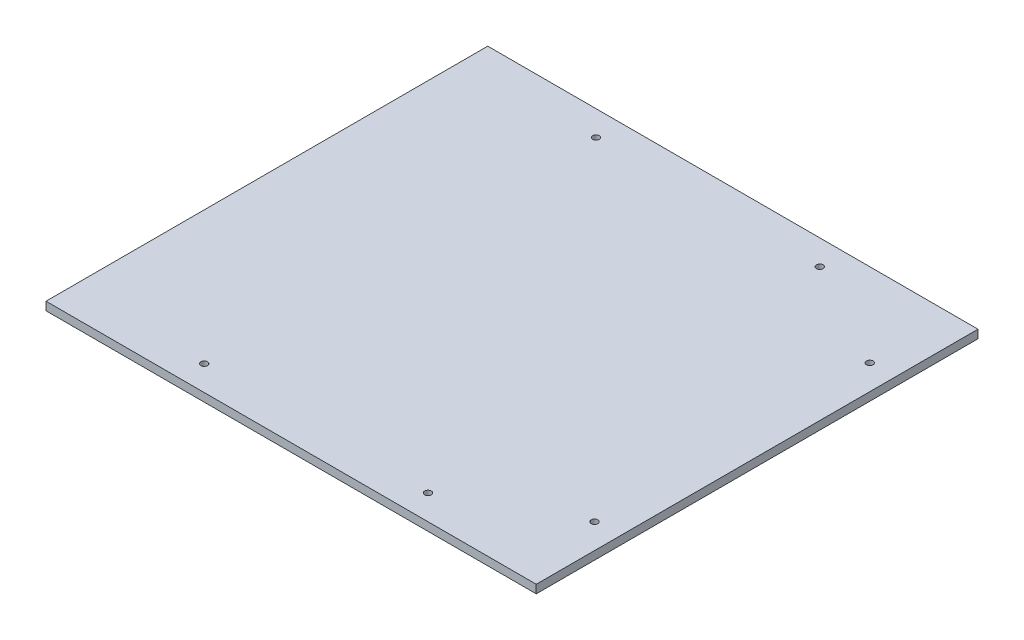
ISO-10303-21;
HEADER;
FILE_DESCRIPTION(('STEP AP214'),'2;1');
FILE_NAME('part.step','',(''),(''),'','','');
FILE_SCHEMA(('AUTOMOTIVE_DESIGN { 1 0 10303 214 1 1 1 1 }'));
ENDSEC;
DATA;
#1=APPLICATION_CONTEXT('core data for automotive mechanical design processes');
#2=APPLICATION_PROTOCOL_DEFINITION('international standard','automotive_design',2000,#1);
#3=PRODUCT_CONTEXT('',#1,'mechanical');
#4=PRODUCT('Part','Part','',(#3));
#5=PRODUCT_RELATED_PRODUCT_CATEGORY('part','',(#4));
#6=PRODUCT_DEFINITION_FORMATION('','',#4);
#7=PRODUCT_DEFINITION_CONTEXT('part definition',#1,'design');
#8=PRODUCT_DEFINITION('design','',#6,#7);
#9=PRODUCT_DEFINITION_SHAPE('','',#8);
#10=(LENGTH_UNIT() NAMED_UNIT(*) SI_UNIT(.MILLI.,.METRE.));
#11=(NAMED_UNIT(*) PLANE_ANGLE_UNIT() SI_UNIT($,.RADIAN.));
#12=(NAMED_UNIT(*) SI_UNIT($,.STERADIAN.) SOLID_ANGLE_UNIT());
#13=UNCERTAINTY_MEASURE_WITH_UNIT(LENGTH_MEASURE(1.E-05),#10,'distance_accuracy_value','');
#14=(GEOMETRIC_REPRESENTATION_CONTEXT(3) GLOBAL_UNCERTAINTY_ASSIGNED_CONTEXT((#13)) GLOBAL_UNIT_ASSIGNED_CONTEXT((#10,
#11,#12)) REPRESENTATION_CONTEXT('',''));
#15=CARTESIAN_POINT('',(0.,0.,0.));
#16=DIRECTION('',(0.,0.,1.));
#17=DIRECTION('',(1.,0.,0.));
#18=AXIS2_PLACEMENT_3D('',#15,#16,#17);
#19=CARTESIAN_POINT('',(-147.2,5.,-132.64));
#20=DIRECTION('',(1.,0.,0.));
#21=DIRECTION('',(0.,0.,-1.));
#22=AXIS2_PLACEMENT_3D('',#19,#20,#21);
#23=PLANE('',#22);
#24=DIRECTION('',(0.,0.,1.));
#25=VECTOR('',#24,1.);
#26=CARTESIAN_POINT('',(-147.2,0.,-132.64));
#27=LINE('',#26,#25);
#28=CARTESIAN_POINT('',(-147.2,0.,-132.64));
#29=VERTEX_POINT('',#28);
#30=CARTESIAN_POINT('',(-147.2,0.,132.64));
#31=VERTEX_POINT('',#30);
#32=EDGE_CURVE('E112',#29,#31,#27,.T.);
#33=ORIENTED_EDGE('',*,*,#32,.T.);
#34=DIRECTION('',(0.,-1.,0.));
#35=VECTOR('',#34,1.);
#36=CARTESIAN_POINT('',(-147.2,5.,132.64));
#37=LINE('',#36,#35);
#38=CARTESIAN_POINT('',(-147.2,5.,132.64));
#39=VERTEX_POINT('',#38);
#40=EDGE_CURVE('E11',#39,#31,#37,.T.);
#41=ORIENTED_EDGE('',*,*,#40,.F.);
#42=DIRECTION('',(0.,0.,1.));
#43=VECTOR('',#42,1.);
#44=CARTESIAN_POINT('',(-147.2,5.,-132.64));
#45=LINE('',#44,#43);
#46=CARTESIAN_POINT('',(-147.2,5.,-132.64));
#47=VERTEX_POINT('',#46);
#48=EDGE_CURVE('E96',#47,#39,#45,.T.);
#49=ORIENTED_EDGE('',*,*,#48,.F.);
#50=DIRECTION('',(0.,-1.,0.));
#51=VECTOR('',#50,1.);
#52=CARTESIAN_POINT('',(-147.2,5.,-132.64));
#53=LINE('',#52,#51);
#54=EDGE_CURVE('E108',#47,#29,#53,.T.);
#55=ORIENTED_EDGE('',*,*,#54,.T.);
#56=EDGE_LOOP('',(#33,#41,#49,#55));
#57=FACE_BOUND('',#56,.T.);
#58=ADVANCED_FACE('F44',(#57),#23,.F.);
#59=CARTESIAN_POINT('',(-147.2,5.,132.64));
#60=DIRECTION('',(0.,0.,-1.));
#61=DIRECTION('',(-1.,0.,0.));
#62=AXIS2_PLACEMENT_3D('',#59,#60,#61);
#63=PLANE('',#62);
#64=DIRECTION('',(1.,0.,0.));
#65=VECTOR('',#64,1.);
#66=CARTESIAN_POINT('',(-147.2,0.,132.64));
#67=LINE('',#66,#65);
#68=CARTESIAN_POINT('',(147.2,0.,132.64));
#69=VERTEX_POINT('',#68);
#70=EDGE_CURVE('E101',#31,#69,#67,.T.);
#71=ORIENTED_EDGE('',*,*,#70,.T.);
#72=DIRECTION('',(0.,-1.,0.));
#73=VECTOR('',#72,1.);
#74=CARTESIAN_POINT('',(147.2,5.,132.64));
#75=LINE('',#74,#73);
#76=CARTESIAN_POINT('',(147.2,5.,132.64));
#77=VERTEX_POINT('',#76);
#78=EDGE_CURVE('E53',#77,#69,#75,.T.);
#79=ORIENTED_EDGE('',*,*,#78,.F.);
#80=DIRECTION('',(1.,0.,0.));
#81=VECTOR('',#80,1.);
#82=CARTESIAN_POINT('',(-147.2,5.,132.64));
#83=LINE('',#82,#81);
#84=EDGE_CURVE('E91',#39,#77,#83,.T.);
#85=ORIENTED_EDGE('',*,*,#84,.F.);
#86=ORIENTED_EDGE('',*,*,#40,.T.);
#87=EDGE_LOOP('',(#71,#79,#85,#86));
#88=FACE_BOUND('',#87,.T.);
#89=ADVANCED_FACE('F100',(#88),#63,.F.);
#90=CARTESIAN_POINT('',(147.2,5.,-132.64));
#91=DIRECTION('',(-1.,0.,0.));
#92=DIRECTION('',(0.,0.,1.));
#93=AXIS2_PLACEMENT_3D('',#90,#91,#92);
#94=PLANE('',#93);
#95=DIRECTION('',(0.,0.,-1.));
#96=VECTOR('',#95,1.);
#97=CARTESIAN_POINT('',(147.2,0.,-132.64));
#98=LINE('',#97,#96);
#99=CARTESIAN_POINT('',(147.2,0.,-132.64));
#100=VERTEX_POINT('',#99);
#101=EDGE_CURVE('E78',#69,#100,#98,.T.);
#102=ORIENTED_EDGE('',*,*,#101,.T.);
#103=DIRECTION('',(0.,-1.,0.));
#104=VECTOR('',#103,1.);
#105=CARTESIAN_POINT('',(147.2,5.,-132.64));
#106=LINE('',#105,#104);
#107=CARTESIAN_POINT('',(147.2,5.,-132.64));
#108=VERTEX_POINT('',#107);
#109=EDGE_CURVE('E103',#108,#100,#106,.T.);
#110=ORIENTED_EDGE('',*,*,#109,.F.);
#111=DIRECTION('',(0.,0.,-1.));
#112=VECTOR('',#111,1.);
#113=CARTESIAN_POINT('',(147.2,5.,-132.64));
#114=LINE('',#113,#112);
#115=EDGE_CURVE('E94',#77,#108,#114,.T.);
#116=ORIENTED_EDGE('',*,*,#115,.F.);
#117=ORIENTED_EDGE('',*,*,#78,.T.);
#118=EDGE_LOOP('',(#102,#110,#116,#117));
#119=FACE_BOUND('',#118,.T.);
#120=ADVANCED_FACE('F104',(#119),#94,.F.);
#121=CARTESIAN_POINT('',(-147.2,5.,-132.64));
#122=DIRECTION('',(0.,0.,1.));
#123=DIRECTION('',(1.,0.,0.));
#124=AXIS2_PLACEMENT_3D('',#121,#122,#123);
#125=PLANE('',#124);
#126=DIRECTION('',(-1.,0.,0.));
#127=VECTOR('',#126,1.);
#128=CARTESIAN_POINT('',(-147.2,0.,-132.64));
#129=LINE('',#128,#127);
#130=EDGE_CURVE('E84',#100,#29,#129,.T.);
#131=ORIENTED_EDGE('',*,*,#130,.T.);
#132=ORIENTED_EDGE('',*,*,#54,.F.);
#133=DIRECTION('',(-1.,0.,0.));
#134=VECTOR('',#133,1.);
#135=CARTESIAN_POINT('',(-147.2,5.,-132.64));
#136=LINE('',#135,#134);
#137=EDGE_CURVE('E61',#108,#47,#136,.T.);
#138=ORIENTED_EDGE('',*,*,#137,.F.);
#139=ORIENTED_EDGE('',*,*,#109,.T.);
#140=EDGE_LOOP('',(#131,#132,#138,#139));
#141=FACE_BOUND('',#140,.T.);
#142=ADVANCED_FACE('F126',(#141),#125,.F.);
#143=CARTESIAN_POINT('',(0.,5.,0.));
#144=DIRECTION('',(0.,1.,0.));
#145=DIRECTION('',(0.,0.,1.));
#146=AXIS2_PLACEMENT_3D('',#143,#144,#145);
#147=PLANE('',#146);
#148=CARTESIAN_POINT('',(-67.2,5.,117.64));
#149=DIRECTION('',(0.,1.,0.));
#150=DIRECTION('',(0.,0.,-1.));
#151=AXIS2_PLACEMENT_3D('',#148,#149,#150);
#152=CIRCLE('',#151,2.);
#153=CARTESIAN_POINT('',(-67.2,5.,115.64));
#154=VERTEX_POINT('',#153);
#155=EDGE_CURVE('E161',#154,#154,#152,.T.);
#156=ORIENTED_EDGE('',*,*,#155,.F.);
#157=EDGE_LOOP('',(#156));
#158=FACE_BOUND('',#157,.T.);
#159=CARTESIAN_POINT('',(67.2,5.,117.64));
#160=DIRECTION('',(0.,1.,0.));
#161=DIRECTION('',(0.,0.,-1.));
#162=AXIS2_PLACEMENT_3D('',#159,#160,#161);
#163=CIRCLE('',#162,2.);
#164=CARTESIAN_POINT('',(67.2,5.,115.64));
#165=VERTEX_POINT('',#164);
#166=EDGE_CURVE('E169',#165,#165,#163,.T.);
#167=ORIENTED_EDGE('',*,*,#166,.F.);
#168=EDGE_LOOP('',(#167));
#169=FACE_BOUND('',#168,.T.);
#170=CARTESIAN_POINT('',(67.2,5.,-117.64));
#171=DIRECTION('',(0.,1.,0.));
#172=DIRECTION('',(0.,0.,1.));
#173=AXIS2_PLACEMENT_3D('',#170,#171,#172);
#174=CIRCLE('',#173,2.);
#175=CARTESIAN_POINT('',(67.2,5.,-115.64));
#176=VERTEX_POINT('',#175);
#177=EDGE_CURVE('E153',#176,#176,#174,.T.);
#178=ORIENTED_EDGE('',*,*,#177,.F.);
#179=EDGE_LOOP('',(#178));
#180=FACE_BOUND('',#179,.T.);
#181=CARTESIAN_POINT('',(-67.2,5.,-117.64));
#182=DIRECTION('',(0.,1.,0.));
#183=DIRECTION('',(0.,0.,1.));
#184=AXIS2_PLACEMENT_3D('',#181,#182,#183);
#185=CIRCLE('',#184,2.);
#186=CARTESIAN_POINT('',(-67.2,5.,-115.64));
#187=VERTEX_POINT('',#186);
#188=EDGE_CURVE('E149',#187,#187,#185,.T.);
#189=ORIENTED_EDGE('',*,*,#188,.F.);
#190=EDGE_LOOP('',(#189));
#191=FACE_BOUND('',#190,.T.);
#192=CARTESIAN_POINT('',(132.2,5.,82.64));
#193=DIRECTION('',(0.,1.,0.));
#194=DIRECTION('',(0.,0.,1.));
#195=AXIS2_PLACEMENT_3D('',#192,#193,#194);
#196=CIRCLE('',#195,2.);
#197=CARTESIAN_POINT('',(132.2,5.,84.64));
#198=VERTEX_POINT('',#197);
#199=EDGE_CURVE('E142',#198,#198,#196,.T.);
#200=ORIENTED_EDGE('',*,*,#199,.F.);
#201=EDGE_LOOP('',(#200));
#202=FACE_BOUND('',#201,.T.);
#203=CARTESIAN_POINT('',(132.2,5.,-82.64));
#204=DIRECTION('',(0.,1.,0.));
#205=DIRECTION('',(0.,0.,1.));
#206=AXIS2_PLACEMENT_3D('',#203,#204,#205);
#207=CIRCLE('',#206,2.);
#208=CARTESIAN_POINT('',(132.2,5.,-80.64));
#209=VERTEX_POINT('',#208);
#210=EDGE_CURVE('E137',#209,#209,#207,.T.);
#211=ORIENTED_EDGE('',*,*,#210,.F.);
#212=EDGE_LOOP('',(#211));
#213=FACE_BOUND('',#212,.T.);
#214=ORIENTED_EDGE('',*,*,#48,.T.);
#215=ORIENTED_EDGE('',*,*,#84,.T.);
#216=ORIENTED_EDGE('',*,*,#115,.T.);
#217=ORIENTED_EDGE('',*,*,#137,.T.);
#218=EDGE_LOOP('',(#214,#215,#216,#217));
#219=FACE_BOUND('',#218,.T.);
#220=ADVANCED_FACE('F92',(#158,#169,#180,#191,#202,#213,#219),#147,.T.);
#221=CARTESIAN_POINT('',(0.,0.,0.));
#222=DIRECTION('',(0.,1.,0.));
#223=DIRECTION('',(0.,0.,1.));
#224=AXIS2_PLACEMENT_3D('',#221,#222,#223);
#225=PLANE('',#224);
#226=CARTESIAN_POINT('',(-67.2,0.,117.64));
#227=DIRECTION('',(0.,1.,0.));
#228=DIRECTION('',(0.,0.,-1.));
#229=AXIS2_PLACEMENT_3D('',#226,#227,#228);
#230=CIRCLE('',#229,2.);
#231=CARTESIAN_POINT('',(-67.2,0.,115.64));
#232=VERTEX_POINT('',#231);
#233=EDGE_CURVE('E157',#232,#232,#230,.T.);
#234=ORIENTED_EDGE('',*,*,#233,.T.);
#235=EDGE_LOOP('',(#234));
#236=FACE_BOUND('',#235,.T.);
#237=CARTESIAN_POINT('',(67.2,0.,117.64));
#238=DIRECTION('',(0.,1.,0.));
#239=DIRECTION('',(0.,0.,-1.));
#240=AXIS2_PLACEMENT_3D('',#237,#238,#239);
#241=CIRCLE('',#240,2.);
#242=CARTESIAN_POINT('',(67.2,0.,115.64));
#243=VERTEX_POINT('',#242);
#244=EDGE_CURVE('E165',#243,#243,#241,.T.);
#245=ORIENTED_EDGE('',*,*,#244,.T.);
#246=EDGE_LOOP('',(#245));
#247=FACE_BOUND('',#246,.T.);
#248=CARTESIAN_POINT('',(67.2,0.,-117.64));
#249=DIRECTION('',(0.,1.,0.));
#250=DIRECTION('',(0.,0.,1.));
#251=AXIS2_PLACEMENT_3D('',#248,#249,#250);
#252=CIRCLE('',#251,2.);
#253=CARTESIAN_POINT('',(67.2,0.,-115.64));
#254=VERTEX_POINT('',#253);
#255=EDGE_CURVE('E173',#254,#254,#252,.T.);
#256=ORIENTED_EDGE('',*,*,#255,.T.);
#257=EDGE_LOOP('',(#256));
#258=FACE_BOUND('',#257,.T.);
#259=CARTESIAN_POINT('',(-67.2,0.,-117.64));
#260=DIRECTION('',(0.,1.,0.));
#261=DIRECTION('',(0.,0.,1.));
#262=AXIS2_PLACEMENT_3D('',#259,#260,#261);
#263=CIRCLE('',#262,2.);
#264=CARTESIAN_POINT('',(-67.2,0.,-115.64));
#265=VERTEX_POINT('',#264);
#266=EDGE_CURVE('E138',#265,#265,#263,.T.);
#267=ORIENTED_EDGE('',*,*,#266,.T.);
#268=EDGE_LOOP('',(#267));
#269=FACE_BOUND('',#268,.T.);
#270=CARTESIAN_POINT('',(132.2,0.,82.64));
#271=DIRECTION('',(0.,1.,0.));
#272=DIRECTION('',(0.,0.,1.));
#273=AXIS2_PLACEMENT_3D('',#270,#271,#272);
#274=CIRCLE('',#273,2.);
#275=CARTESIAN_POINT('',(132.2,0.,84.64));
#276=VERTEX_POINT('',#275);
#277=EDGE_CURVE('E116',#276,#276,#274,.T.);
#278=ORIENTED_EDGE('',*,*,#277,.T.);
#279=EDGE_LOOP('',(#278));
#280=FACE_BOUND('',#279,.T.);
#281=CARTESIAN_POINT('',(132.2,0.,-82.64));
#282=DIRECTION('',(0.,1.,0.));
#283=DIRECTION('',(0.,0.,1.));
#284=AXIS2_PLACEMENT_3D('',#281,#282,#283);
#285=CIRCLE('',#284,2.);
#286=CARTESIAN_POINT('',(132.2,0.,-80.64));
#287=VERTEX_POINT('',#286);
#288=EDGE_CURVE('E133',#287,#287,#285,.T.);
#289=ORIENTED_EDGE('',*,*,#288,.T.);
#290=EDGE_LOOP('',(#289));
#291=FACE_BOUND('',#290,.T.);
#292=ORIENTED_EDGE('',*,*,#32,.F.);
#293=ORIENTED_EDGE('',*,*,#130,.F.);
#294=ORIENTED_EDGE('',*,*,#101,.F.);
#295=ORIENTED_EDGE('',*,*,#70,.F.);
#296=EDGE_LOOP('',(#292,#293,#294,#295));
#297=FACE_BOUND('',#296,.T.);
#298=ADVANCED_FACE('F129',(#236,#247,#258,#269,#280,#291,#297),#225,.F.);
#299=CARTESIAN_POINT('',(132.2,0.,-82.64));
#300=DIRECTION('',(0.,1.,0.));
#301=DIRECTION('',(0.,0.,1.));
#302=AXIS2_PLACEMENT_3D('',#299,#300,#301);
#303=CYLINDRICAL_SURFACE('',#302,2.);
#304=ORIENTED_EDGE('',*,*,#288,.F.);
#305=EDGE_LOOP('',(#304));
#306=FACE_BOUND('',#305,.T.);
#307=ORIENTED_EDGE('',*,*,#210,.T.);
#308=EDGE_LOOP('',(#307));
#309=FACE_BOUND('',#308,.T.);
#310=ADVANCED_FACE('F193',(#306,#309),#303,.F.);
#311=CARTESIAN_POINT('',(132.2,0.,82.64));
#312=DIRECTION('',(0.,1.,0.));
#313=DIRECTION('',(0.,0.,1.));
#314=AXIS2_PLACEMENT_3D('',#311,#312,#313);
#315=CYLINDRICAL_SURFACE('',#314,2.);
#316=ORIENTED_EDGE('',*,*,#277,.F.);
#317=EDGE_LOOP('',(#316));
#318=FACE_BOUND('',#317,.T.);
#319=ORIENTED_EDGE('',*,*,#199,.T.);
#320=EDGE_LOOP('',(#319));
#321=FACE_BOUND('',#320,.T.);
#322=ADVANCED_FACE('F195',(#318,#321),#315,.F.);
#323=CARTESIAN_POINT('',(-67.2,0.,-117.64));
#324=DIRECTION('',(0.,1.,0.));
#325=DIRECTION('',(0.,0.,1.));
#326=AXIS2_PLACEMENT_3D('',#323,#324,#325);
#327=CYLINDRICAL_SURFACE('',#326,2.);
#328=ORIENTED_EDGE('',*,*,#266,.F.);
#329=EDGE_LOOP('',(#328));
#330=FACE_BOUND('',#329,.T.);
#331=ORIENTED_EDGE('',*,*,#188,.T.);
#332=EDGE_LOOP('',(#331));
#333=FACE_BOUND('',#332,.T.);
#334=ADVANCED_FACE('F202',(#330,#333),#327,.F.);
#335=CARTESIAN_POINT('',(67.2,0.,-117.64));
#336=DIRECTION('',(0.,1.,0.));
#337=DIRECTION('',(0.,0.,1.));
#338=AXIS2_PLACEMENT_3D('',#335,#336,#337);
#339=CYLINDRICAL_SURFACE('',#338,2.);
#340=ORIENTED_EDGE('',*,*,#255,.F.);
#341=EDGE_LOOP('',(#340));
#342=FACE_BOUND('',#341,.T.);
#343=ORIENTED_EDGE('',*,*,#177,.T.);
#344=EDGE_LOOP('',(#343));
#345=FACE_BOUND('',#344,.T.);
#346=ADVANCED_FACE('F181',(#342,#345),#339,.F.);
#347=CARTESIAN_POINT('',(67.2,0.,117.64));
#348=DIRECTION('',(0.,1.,0.));
#349=DIRECTION('',(0.,0.,1.));
#350=AXIS2_PLACEMENT_3D('',#347,#348,#349);
#351=CYLINDRICAL_SURFACE('',#350,2.);
#352=ORIENTED_EDGE('',*,*,#244,.F.);
#353=EDGE_LOOP('',(#352));
#354=FACE_BOUND('',#353,.T.);
#355=ORIENTED_EDGE('',*,*,#166,.T.);
#356=EDGE_LOOP('',(#355));
#357=FACE_BOUND('',#356,.T.);
#358=ADVANCED_FACE('F270',(#354,#357),#351,.F.);
#359=CARTESIAN_POINT('',(-67.2,0.,117.64));
#360=DIRECTION('',(0.,1.,0.));
#361=DIRECTION('',(0.,0.,1.));
#362=AXIS2_PLACEMENT_3D('',#359,#360,#361);
#363=CYLINDRICAL_SURFACE('',#362,2.);
#364=ORIENTED_EDGE('',*,*,#233,.F.);
#365=EDGE_LOOP('',(#364));
#366=FACE_BOUND('',#365,.T.);
#367=ORIENTED_EDGE('',*,*,#155,.T.);
#368=EDGE_LOOP('',(#367));
#369=FACE_BOUND('',#368,.T.);
#370=ADVANCED_FACE('F279',(#366,#369),#363,.F.);
#371=CLOSED_SHELL('',(#58,#89,#120,#142,#220,#298,#310,#322,#334,#346,#358,#370));
#372=MANIFOLD_SOLID_BREP('B2',#371);
#373=ADVANCED_BREP_SHAPE_REPRESENTATION('',(#18,#372),#14);
#374=SHAPE_DEFINITION_REPRESENTATION(#9,#373);
ENDSEC;
END-ISO-10303-21;
